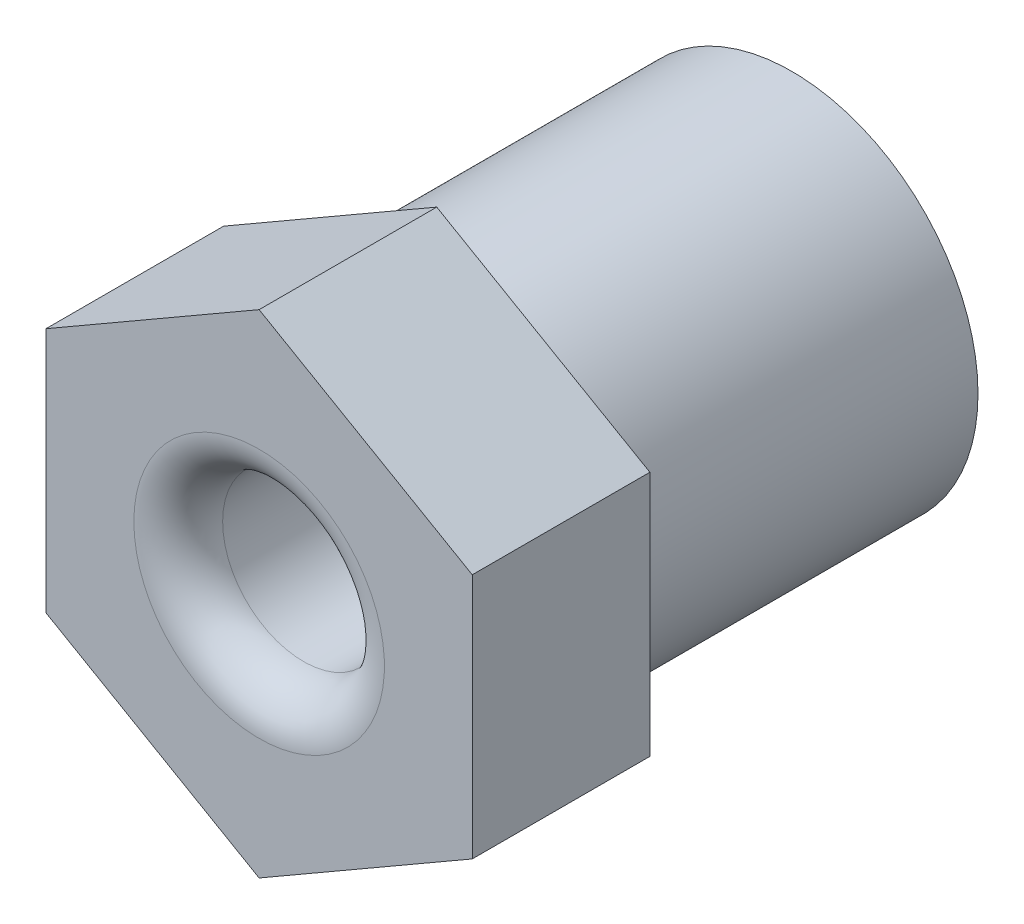
ISO-10303-21;
HEADER;
FILE_DESCRIPTION(('STEP AP214'),'2;1');
FILE_NAME('part.step','',(''),(''),'','','');
FILE_SCHEMA(('AUTOMOTIVE_DESIGN { 1 0 10303 214 1 1 1 1 }'));
ENDSEC;
DATA;
#1=APPLICATION_CONTEXT('core data for automotive mechanical design processes');
#2=APPLICATION_PROTOCOL_DEFINITION('international standard','automotive_design',2000,#1);
#3=PRODUCT_CONTEXT('',#1,'mechanical');
#4=PRODUCT('Part','Part','',(#3));
#5=PRODUCT_RELATED_PRODUCT_CATEGORY('part','',(#4));
#6=PRODUCT_DEFINITION_FORMATION('','',#4);
#7=PRODUCT_DEFINITION_CONTEXT('part definition',#1,'design');
#8=PRODUCT_DEFINITION('design','',#6,#7);
#9=PRODUCT_DEFINITION_SHAPE('','',#8);
#10=(LENGTH_UNIT() NAMED_UNIT(*) SI_UNIT(.MILLI.,.METRE.));
#11=(NAMED_UNIT(*) PLANE_ANGLE_UNIT() SI_UNIT($,.RADIAN.));
#12=(NAMED_UNIT(*) SI_UNIT($,.STERADIAN.) SOLID_ANGLE_UNIT());
#13=UNCERTAINTY_MEASURE_WITH_UNIT(LENGTH_MEASURE(1.E-05),#10,'distance_accuracy_value','');
#14=(GEOMETRIC_REPRESENTATION_CONTEXT(3) GLOBAL_UNCERTAINTY_ASSIGNED_CONTEXT((#13)) GLOBAL_UNIT_ASSIGNED_CONTEXT((#10,
#11,#12)) REPRESENTATION_CONTEXT('',''));
#15=CARTESIAN_POINT('',(0.,0.,0.));
#16=DIRECTION('',(0.,0.,1.));
#17=DIRECTION('',(1.,0.,0.));
#18=AXIS2_PLACEMENT_3D('',#15,#16,#17);
#19=CARTESIAN_POINT('',(-3.65791116486798,3.45094953686021,0.));
#20=DIRECTION('',(0.,0.,1.));
#21=DIRECTION('',(1.,0.,0.));
#22=AXIS2_PLACEMENT_3D('',#19,#20,#21);
#23=PLANE('',#22);
#24=CARTESIAN_POINT('',(-3.65791116486798,3.45094953686021,0.));
#25=DIRECTION('',(0.,0.,1.));
#26=DIRECTION('',(-1.,0.,0.));
#27=AXIS2_PLACEMENT_3D('',#24,#25,#26);
#28=CIRCLE('',#27,0.91087);
#29=CARTESIAN_POINT('',(-4.56878116486798,3.45094953686021,0.));
#30=VERTEX_POINT('',#29);
#31=EDGE_CURVE('E117',#30,#30,#28,.T.);
#32=ORIENTED_EDGE('',*,*,#31,.T.);
#33=EDGE_LOOP('',(#32));
#34=FACE_BOUND('',#33,.T.);
#35=CARTESIAN_POINT('',(-3.65791116486798,3.45094953686021,0.));
#36=DIRECTION('',(0.,0.,-1.));
#37=DIRECTION('',(1.,0.,0.));
#38=AXIS2_PLACEMENT_3D('',#35,#36,#37);
#39=CIRCLE('',#38,1.6);
#40=CARTESIAN_POINT('',(-2.05791116486798,3.45094953686021,0.));
#41=VERTEX_POINT('',#40);
#42=EDGE_CURVE('E179',#41,#41,#39,.T.);
#43=ORIENTED_EDGE('',*,*,#42,.T.);
#44=EDGE_LOOP('',(#43));
#45=FACE_BOUND('',#44,.T.);
#46=ADVANCED_FACE('F17',(#34,#45),#23,.F.);
#47=CARTESIAN_POINT('',(-1.25791116486653,4.83659053686006,0.));
#48=DIRECTION('',(1.,0.,0.));
#49=DIRECTION('',(0.,1.,0.));
#50=AXIS2_PLACEMENT_3D('',#47,#48,#49);
#51=PLANE('',#50);
#52=DIRECTION('',(0.,-1.,0.));
#53=VECTOR('',#52,1.);
#54=CARTESIAN_POINT('',(-1.25791116486653,4.83659053686006,2.));
#55=LINE('',#54,#53);
#56=CARTESIAN_POINT('',(-1.25791116486653,4.83659053686006,2.));
#57=VERTEX_POINT('',#56);
#58=CARTESIAN_POINT('',(-1.25791116486653,2.06530853686036,2.));
#59=VERTEX_POINT('',#58);
#60=EDGE_CURVE('E92',#57,#59,#55,.T.);
#61=ORIENTED_EDGE('',*,*,#60,.T.);
#62=DIRECTION('',(0.,0.,1.));
#63=VECTOR('',#62,1.);
#64=CARTESIAN_POINT('',(-1.25791116486653,2.06530853686036,0.));
#65=LINE('',#64,#63);
#66=CARTESIAN_POINT('',(-1.25791116486653,2.06530853686036,0.));
#67=VERTEX_POINT('',#66);
#68=EDGE_CURVE('E135',#67,#59,#65,.T.);
#69=ORIENTED_EDGE('',*,*,#68,.F.);
#70=DIRECTION('',(0.,-1.,0.));
#71=VECTOR('',#70,1.);
#72=CARTESIAN_POINT('',(-1.25791116486653,4.83659053686006,0.));
#73=LINE('',#72,#71);
#74=CARTESIAN_POINT('',(-1.25791116486653,4.83659053686006,0.));
#75=VERTEX_POINT('',#74);
#76=EDGE_CURVE('E95',#75,#67,#73,.T.);
#77=ORIENTED_EDGE('',*,*,#76,.F.);
#78=DIRECTION('',(0.,0.,1.));
#79=VECTOR('',#78,1.);
#80=CARTESIAN_POINT('',(-1.25791116486653,4.83659053686006,0.));
#81=LINE('',#80,#79);
#82=EDGE_CURVE('E11',#75,#57,#81,.T.);
#83=ORIENTED_EDGE('',*,*,#82,.T.);
#84=EDGE_LOOP('',(#61,#69,#77,#83));
#85=FACE_BOUND('',#84,.T.);
#86=ADVANCED_FACE('F90',(#85),#51,.T.);
#87=CARTESIAN_POINT('',(-3.65791116486798,6.22223053686048,0.));
#88=DIRECTION('',(0.499999825156066,0.866025504730608,0.));
#89=DIRECTION('',(0.,0.,-1.));
#90=AXIS2_PLACEMENT_3D('',#87,#88,#89);
#91=PLANE('',#90);
#92=DIRECTION('',(0.866025504730608,-0.499999825156065,0.));
#93=VECTOR('',#92,1.);
#94=CARTESIAN_POINT('',(-3.65791116486798,6.22223053686048,2.));
#95=LINE('',#94,#93);
#96=CARTESIAN_POINT('',(-3.65791116486798,6.22223053686048,2.));
#97=VERTEX_POINT('',#96);
#98=EDGE_CURVE('E100',#97,#57,#95,.T.);
#99=ORIENTED_EDGE('',*,*,#98,.T.);
#100=ORIENTED_EDGE('',*,*,#82,.F.);
#101=DIRECTION('',(0.866025504730608,-0.499999825156065,0.));
#102=VECTOR('',#101,1.);
#103=CARTESIAN_POINT('',(-3.65791116486798,6.22223053686048,0.));
#104=LINE('',#103,#102);
#105=CARTESIAN_POINT('',(-3.65791116486798,6.22223053686048,0.));
#106=VERTEX_POINT('',#105);
#107=EDGE_CURVE('E147',#106,#75,#104,.T.);
#108=ORIENTED_EDGE('',*,*,#107,.F.);
#109=DIRECTION('',(0.,0.,1.));
#110=VECTOR('',#109,1.);
#111=CARTESIAN_POINT('',(-3.65791116486798,6.22223053686048,0.));
#112=LINE('',#111,#110);
#113=EDGE_CURVE('E26',#106,#97,#112,.T.);
#114=ORIENTED_EDGE('',*,*,#113,.T.);
#115=EDGE_LOOP('',(#99,#100,#108,#114));
#116=FACE_BOUND('',#115,.T.);
#117=ADVANCED_FACE('F101',(#116),#91,.T.);
#118=CARTESIAN_POINT('',(-6.05791116486944,4.83659053686006,0.));
#119=DIRECTION('',(-0.499999825156066,0.866025504730608,0.));
#120=DIRECTION('',(0.,0.,1.));
#121=AXIS2_PLACEMENT_3D('',#118,#119,#120);
#122=PLANE('',#121);
#123=DIRECTION('',(0.866025504730608,0.499999825156065,0.));
#124=VECTOR('',#123,1.);
#125=CARTESIAN_POINT('',(-6.05791116486944,4.83659053686006,2.));
#126=LINE('',#125,#124);
#127=CARTESIAN_POINT('',(-6.05791116486944,4.83659053686006,2.));
#128=VERTEX_POINT('',#127);
#129=EDGE_CURVE('E105',#128,#97,#126,.T.);
#130=ORIENTED_EDGE('',*,*,#129,.T.);
#131=ORIENTED_EDGE('',*,*,#113,.F.);
#132=DIRECTION('',(0.866025504730608,0.499999825156065,0.));
#133=VECTOR('',#132,1.);
#134=CARTESIAN_POINT('',(-6.05791116486944,4.83659053686006,0.));
#135=LINE('',#134,#133);
#136=CARTESIAN_POINT('',(-6.05791116486944,4.83659053686006,0.));
#137=VERTEX_POINT('',#136);
#138=EDGE_CURVE('E150',#137,#106,#135,.T.);
#139=ORIENTED_EDGE('',*,*,#138,.F.);
#140=DIRECTION('',(0.,0.,1.));
#141=VECTOR('',#140,1.);
#142=CARTESIAN_POINT('',(-6.05791116486944,4.83659053686006,0.));
#143=LINE('',#142,#141);
#144=EDGE_CURVE('E48',#137,#128,#143,.T.);
#145=ORIENTED_EDGE('',*,*,#144,.T.);
#146=EDGE_LOOP('',(#130,#131,#139,#145));
#147=FACE_BOUND('',#146,.T.);
#148=ADVANCED_FACE('F194',(#147),#122,.T.);
#149=CARTESIAN_POINT('',(-6.05791116486944,2.06530853686036,0.));
#150=DIRECTION('',(-1.,0.,0.));
#151=DIRECTION('',(0.,0.,1.));
#152=AXIS2_PLACEMENT_3D('',#149,#150,#151);
#153=PLANE('',#152);
#154=DIRECTION('',(0.,1.,0.));
#155=VECTOR('',#154,1.);
#156=CARTESIAN_POINT('',(-6.05791116486944,2.06530853686036,2.));
#157=LINE('',#156,#155);
#158=CARTESIAN_POINT('',(-6.05791116486944,2.06530853686036,2.));
#159=VERTEX_POINT('',#158);
#160=EDGE_CURVE('E128',#159,#128,#157,.T.);
#161=ORIENTED_EDGE('',*,*,#160,.T.);
#162=ORIENTED_EDGE('',*,*,#144,.F.);
#163=DIRECTION('',(0.,1.,0.));
#164=VECTOR('',#163,1.);
#165=CARTESIAN_POINT('',(-6.05791116486944,2.06530853686036,0.));
#166=LINE('',#165,#164);
#167=CARTESIAN_POINT('',(-6.05791116486944,2.06530853686036,0.));
#168=VERTEX_POINT('',#167);
#169=EDGE_CURVE('E157',#168,#137,#166,.T.);
#170=ORIENTED_EDGE('',*,*,#169,.F.);
#171=DIRECTION('',(0.,0.,1.));
#172=VECTOR('',#171,1.);
#173=CARTESIAN_POINT('',(-6.05791116486944,2.06530853686036,0.));
#174=LINE('',#173,#172);
#175=EDGE_CURVE('E38',#168,#159,#174,.T.);
#176=ORIENTED_EDGE('',*,*,#175,.T.);
#177=EDGE_LOOP('',(#161,#162,#170,#176));
#178=FACE_BOUND('',#177,.T.);
#179=ADVANCED_FACE('F193',(#178),#153,.T.);
#180=CARTESIAN_POINT('',(-3.65791116486798,0.679668536859936,0.));
#181=DIRECTION('',(-0.499999825156065,-0.866025504730608,0.));
#182=DIRECTION('',(-0.866025504730608,0.499999825156065,0.));
#183=AXIS2_PLACEMENT_3D('',#180,#181,#182);
#184=PLANE('',#183);
#185=DIRECTION('',(-0.866025504730608,0.499999825156065,0.));
#186=VECTOR('',#185,1.);
#187=CARTESIAN_POINT('',(-3.65791116486798,0.679668536859936,2.));
#188=LINE('',#187,#186);
#189=CARTESIAN_POINT('',(-3.65791116486798,0.679668536859936,2.));
#190=VERTEX_POINT('',#189);
#191=EDGE_CURVE('E131',#190,#159,#188,.T.);
#192=ORIENTED_EDGE('',*,*,#191,.T.);
#193=ORIENTED_EDGE('',*,*,#175,.F.);
#194=DIRECTION('',(-0.866025504730608,0.499999825156065,0.));
#195=VECTOR('',#194,1.);
#196=CARTESIAN_POINT('',(-3.65791116486798,0.679668536859936,0.));
#197=LINE('',#196,#195);
#198=CARTESIAN_POINT('',(-3.65791116486798,0.679668536859936,0.));
#199=VERTEX_POINT('',#198);
#200=EDGE_CURVE('E158',#199,#168,#197,.T.);
#201=ORIENTED_EDGE('',*,*,#200,.F.);
#202=DIRECTION('',(0.,0.,1.));
#203=VECTOR('',#202,1.);
#204=CARTESIAN_POINT('',(-3.65791116486798,0.679668536859936,0.));
#205=LINE('',#204,#203);
#206=EDGE_CURVE('E132',#199,#190,#205,.T.);
#207=ORIENTED_EDGE('',*,*,#206,.T.);
#208=EDGE_LOOP('',(#192,#193,#201,#207));
#209=FACE_BOUND('',#208,.T.);
#210=ADVANCED_FACE('F19',(#209),#184,.T.);
#211=CARTESIAN_POINT('',(-1.25791116486653,2.06530853686036,0.));
#212=DIRECTION('',(0.499999825156065,-0.866025504730608,0.));
#213=DIRECTION('',(0.,0.,-1.));
#214=AXIS2_PLACEMENT_3D('',#211,#212,#213);
#215=PLANE('',#214);
#216=DIRECTION('',(-0.866025504730608,-0.499999825156065,0.));
#217=VECTOR('',#216,1.);
#218=CARTESIAN_POINT('',(-1.25791116486653,2.06530853686036,2.));
#219=LINE('',#218,#217);
#220=EDGE_CURVE('E110',#59,#190,#219,.T.);
#221=ORIENTED_EDGE('',*,*,#220,.T.);
#222=ORIENTED_EDGE('',*,*,#206,.F.);
#223=DIRECTION('',(-0.866025504730608,-0.499999825156065,0.));
#224=VECTOR('',#223,1.);
#225=CARTESIAN_POINT('',(-1.25791116486653,2.06530853686036,0.));
#226=LINE('',#225,#224);
#227=EDGE_CURVE('E162',#67,#199,#226,.T.);
#228=ORIENTED_EDGE('',*,*,#227,.F.);
#229=ORIENTED_EDGE('',*,*,#68,.T.);
#230=EDGE_LOOP('',(#221,#222,#228,#229));
#231=FACE_BOUND('',#230,.T.);
#232=ADVANCED_FACE('F199',(#231),#215,.T.);
#233=CARTESIAN_POINT('',(-3.65791116486798,3.45094953686021,2.));
#234=DIRECTION('',(0.,0.,1.));
#235=DIRECTION('',(1.,0.,0.));
#236=AXIS2_PLACEMENT_3D('',#233,#234,#235);
#237=PLANE('',#236);
#238=CARTESIAN_POINT('',(-3.65791116486798,3.45094953686021,2.));
#239=DIRECTION('',(0.,0.,1.));
#240=DIRECTION('',(-1.,0.,0.));
#241=AXIS2_PLACEMENT_3D('',#238,#239,#240);
#242=CIRCLE('',#241,1.41087);
#243=CARTESIAN_POINT('',(-5.06878116486799,3.45094953686021,2.));
#244=VERTEX_POINT('',#243);
#245=EDGE_CURVE('E124',#244,#244,#242,.T.);
#246=ORIENTED_EDGE('',*,*,#245,.F.);
#247=EDGE_LOOP('',(#246));
#248=FACE_BOUND('',#247,.T.);
#249=ORIENTED_EDGE('',*,*,#220,.F.);
#250=ORIENTED_EDGE('',*,*,#60,.F.);
#251=ORIENTED_EDGE('',*,*,#98,.F.);
#252=ORIENTED_EDGE('',*,*,#129,.F.);
#253=ORIENTED_EDGE('',*,*,#160,.F.);
#254=ORIENTED_EDGE('',*,*,#191,.F.);
#255=EDGE_LOOP('',(#249,#250,#251,#252,#253,#254));
#256=FACE_BOUND('',#255,.T.);
#257=ADVANCED_FACE('F107',(#248,#256),#237,.T.);
#258=CARTESIAN_POINT('',(-3.65791116486798,3.45094953686021,2.));
#259=DIRECTION('',(0.,0.,-1.));
#260=DIRECTION('',(-1.,0.,0.));
#261=AXIS2_PLACEMENT_3D('',#258,#259,#260);
#262=CYLINDRICAL_SURFACE('',#261,0.91087);
#263=CARTESIAN_POINT('',(-3.65791116486798,3.45094953686021,1.5));
#264=DIRECTION('',(0.,0.,-1.));
#265=DIRECTION('',(-1.,0.,0.));
#266=AXIS2_PLACEMENT_3D('',#263,#264,#265);
#267=CIRCLE('',#266,0.91087);
#268=CARTESIAN_POINT('',(-4.56878116486798,3.45094953686021,1.5));
#269=VERTEX_POINT('',#268);
#270=EDGE_CURVE('E121',#269,#269,#267,.T.);
#271=ORIENTED_EDGE('',*,*,#270,.F.);
#272=EDGE_LOOP('',(#271));
#273=FACE_BOUND('',#272,.T.);
#274=ORIENTED_EDGE('',*,*,#31,.F.);
#275=EDGE_LOOP('',(#274));
#276=FACE_BOUND('',#275,.T.);
#277=ADVANCED_FACE('F207',(#273,#276),#262,.F.);
#278=CARTESIAN_POINT('',(-3.65791116486798,3.45094953686021,1.5));
#279=DIRECTION('',(0.,0.,-1.));
#280=DIRECTION('',(-1.,0.,0.));
#281=AXIS2_PLACEMENT_3D('',#278,#279,#280);
#282=TOROIDAL_SURFACE('',#281,1.41087,0.5);
#283=ORIENTED_EDGE('',*,*,#245,.T.);
#284=EDGE_LOOP('',(#283));
#285=FACE_BOUND('',#284,.T.);
#286=ORIENTED_EDGE('',*,*,#270,.T.);
#287=EDGE_LOOP('',(#286));
#288=FACE_BOUND('',#287,.T.);
#289=ADVANCED_FACE('F248',(#285,#288),#282,.T.);
#290=CARTESIAN_POINT('',(-3.65791116486798,3.45094953686021,0.));
#291=DIRECTION('',(0.,0.,1.));
#292=DIRECTION('',(1.,0.,0.));
#293=AXIS2_PLACEMENT_3D('',#290,#291,#292);
#294=PLANE('',#293);
#295=CARTESIAN_POINT('',(-3.65791116486798,3.45094953686021,0.));
#296=DIRECTION('',(0.,0.,1.));
#297=DIRECTION('',(1.,0.,0.));
#298=AXIS2_PLACEMENT_3D('',#295,#296,#297);
#299=CIRCLE('',#298,2.095);
#300=CARTESIAN_POINT('',(-1.56291116486798,3.45094953686021,0.));
#301=VERTEX_POINT('',#300);
#302=EDGE_CURVE('E168',#301,#301,#299,.T.);
#303=ORIENTED_EDGE('',*,*,#302,.T.);
#304=EDGE_LOOP('',(#303));
#305=FACE_BOUND('',#304,.T.);
#306=ORIENTED_EDGE('',*,*,#76,.T.);
#307=ORIENTED_EDGE('',*,*,#227,.T.);
#308=ORIENTED_EDGE('',*,*,#200,.T.);
#309=ORIENTED_EDGE('',*,*,#169,.T.);
#310=ORIENTED_EDGE('',*,*,#138,.T.);
#311=ORIENTED_EDGE('',*,*,#107,.T.);
#312=EDGE_LOOP('',(#306,#307,#308,#309,#310,#311));
#313=FACE_BOUND('',#312,.T.);
#314=ADVANCED_FACE('F196',(#305,#313),#294,.F.);
#315=CARTESIAN_POINT('',(-3.65791116486798,3.45094953686021,-4.));
#316=DIRECTION('',(0.,0.,1.));
#317=DIRECTION('',(1.,0.,0.));
#318=AXIS2_PLACEMENT_3D('',#315,#316,#317);
#319=PLANE('',#318);
#320=CARTESIAN_POINT('',(-3.65791116486798,3.45094953686021,-4.));
#321=DIRECTION('',(0.,0.,1.));
#322=DIRECTION('',(1.,0.,0.));
#323=AXIS2_PLACEMENT_3D('',#320,#321,#322);
#324=CIRCLE('',#323,1.6);
#325=CARTESIAN_POINT('',(-2.05791116486798,3.45094953686021,-4.));
#326=VERTEX_POINT('',#325);
#327=EDGE_CURVE('E183',#326,#326,#324,.T.);
#328=ORIENTED_EDGE('',*,*,#327,.T.);
#329=EDGE_LOOP('',(#328));
#330=FACE_BOUND('',#329,.T.);
#331=CARTESIAN_POINT('',(-3.65791116486798,3.45094953686021,-4.));
#332=DIRECTION('',(0.,0.,1.));
#333=DIRECTION('',(1.,0.,0.));
#334=AXIS2_PLACEMENT_3D('',#331,#332,#333);
#335=CIRCLE('',#334,2.095);
#336=CARTESIAN_POINT('',(-1.56291116486798,3.45094953686021,-4.));
#337=VERTEX_POINT('',#336);
#338=EDGE_CURVE('E172',#337,#337,#335,.T.);
#339=ORIENTED_EDGE('',*,*,#338,.F.);
#340=EDGE_LOOP('',(#339));
#341=FACE_BOUND('',#340,.T.);
#342=ADVANCED_FACE('F234',(#330,#341),#319,.F.);
#343=CARTESIAN_POINT('',(-3.65791116486798,3.45094953686021,0.));
#344=DIRECTION('',(0.,0.,-1.));
#345=DIRECTION('',(1.,0.,0.));
#346=AXIS2_PLACEMENT_3D('',#343,#344,#345);
#347=CYLINDRICAL_SURFACE('',#346,2.095);
#348=ORIENTED_EDGE('',*,*,#302,.F.);
#349=EDGE_LOOP('',(#348));
#350=FACE_BOUND('',#349,.T.);
#351=ORIENTED_EDGE('',*,*,#338,.T.);
#352=EDGE_LOOP('',(#351));
#353=FACE_BOUND('',#352,.T.);
#354=ADVANCED_FACE('F232',(#350,#353),#347,.T.);
#355=CARTESIAN_POINT('',(-3.65791116486798,3.45094953686021,0.));
#356=DIRECTION('',(0.,0.,-1.));
#357=DIRECTION('',(1.,0.,0.));
#358=AXIS2_PLACEMENT_3D('',#355,#356,#357);
#359=CYLINDRICAL_SURFACE('',#358,1.6);
#360=ORIENTED_EDGE('',*,*,#42,.F.);
#361=EDGE_LOOP('',(#360));
#362=FACE_BOUND('',#361,.T.);
#363=ORIENTED_EDGE('',*,*,#327,.F.);
#364=EDGE_LOOP('',(#363));
#365=FACE_BOUND('',#364,.T.);
#366=ADVANCED_FACE('F230',(#362,#365),#359,.F.);
#367=CLOSED_SHELL('',(#46,#86,#117,#148,#179,#210,#232,#257,#277,#289,#314,#342,#354,#366));
#368=MANIFOLD_SOLID_BREP('B1',#367);
#369=ADVANCED_BREP_SHAPE_REPRESENTATION('',(#18,#368),#14);
#370=SHAPE_DEFINITION_REPRESENTATION(#9,#369);
ENDSEC;
END-ISO-10303-21;
